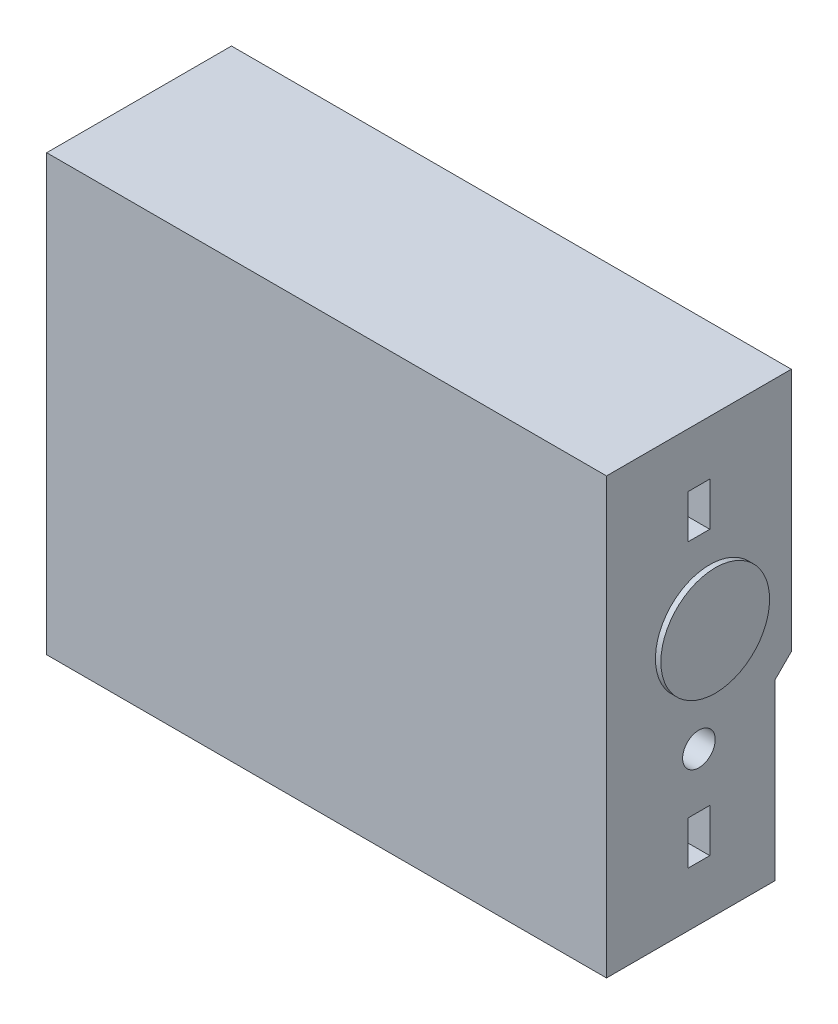
ISO-10303-21;
HEADER;
FILE_DESCRIPTION(('STEP AP214'),'2;1');
FILE_NAME('part.step','',(''),(''),'','','');
FILE_SCHEMA(('AUTOMOTIVE_DESIGN { 1 0 10303 214 1 1 1 1 }'));
ENDSEC;
DATA;
#1=APPLICATION_CONTEXT('core data for automotive mechanical design processes');
#2=APPLICATION_PROTOCOL_DEFINITION('international standard','automotive_design',2000,#1);
#3=PRODUCT_CONTEXT('',#1,'mechanical');
#4=PRODUCT('Part','Part','',(#3));
#5=PRODUCT_RELATED_PRODUCT_CATEGORY('part','',(#4));
#6=PRODUCT_DEFINITION_FORMATION('','',#4);
#7=PRODUCT_DEFINITION_CONTEXT('part definition',#1,'design');
#8=PRODUCT_DEFINITION('design','',#6,#7);
#9=PRODUCT_DEFINITION_SHAPE('','',#8);
#10=(LENGTH_UNIT() NAMED_UNIT(*) SI_UNIT(.MILLI.,.METRE.));
#11=(NAMED_UNIT(*) PLANE_ANGLE_UNIT() SI_UNIT($,.RADIAN.));
#12=(NAMED_UNIT(*) SI_UNIT($,.STERADIAN.) SOLID_ANGLE_UNIT());
#13=UNCERTAINTY_MEASURE_WITH_UNIT(LENGTH_MEASURE(1.E-05),#10,'distance_accuracy_value','');
#14=(GEOMETRIC_REPRESENTATION_CONTEXT(3) GLOBAL_UNCERTAINTY_ASSIGNED_CONTEXT((#13)) GLOBAL_UNIT_ASSIGNED_CONTEXT((#10,
#11,#12)) REPRESENTATION_CONTEXT('',''));
#15=CARTESIAN_POINT('',(0.,0.,0.));
#16=DIRECTION('',(0.,0.,1.));
#17=DIRECTION('',(1.,0.,0.));
#18=AXIS2_PLACEMENT_3D('',#15,#16,#17);
#19=CARTESIAN_POINT('',(51.5,40.,34.));
#20=DIRECTION('',(-1.,0.,0.));
#21=DIRECTION('',(0.,-1.,0.));
#22=AXIS2_PLACEMENT_3D('',#19,#20,#21);
#23=PLANE('',#22);
#24=CARTESIAN_POINT('',(51.5,6.36724846570491,15.));
#25=DIRECTION('',(-1.,0.,0.));
#26=DIRECTION('',(0.,-1.,0.));
#27=AXIS2_PLACEMENT_3D('',#24,#25,#26);
#28=CIRCLE('',#27,10.);
#29=CARTESIAN_POINT('',(51.5,-3.63275153429509,15.));
#30=VERTEX_POINT('',#29);
#31=EDGE_CURVE('E11',#30,#30,#28,.F.);
#32=ORIENTED_EDGE('',*,*,#31,.F.);
#33=EDGE_LOOP('',(#32));
#34=FACE_BOUND('',#33,.T.);
#35=DIRECTION('',(0.,0.,1.));
#36=VECTOR('',#35,1.);
#37=CARTESIAN_POINT('',(51.5,30.,19.));
#38=LINE('',#37,#36);
#39=CARTESIAN_POINT('',(51.5,30.,15.));
#40=VERTEX_POINT('',#39);
#41=CARTESIAN_POINT('',(51.5,30.,19.));
#42=VERTEX_POINT('',#41);
#43=EDGE_CURVE('E297',#40,#42,#38,.T.);
#44=ORIENTED_EDGE('',*,*,#43,.F.);
#45=DIRECTION('',(0.,1.,0.));
#46=VECTOR('',#45,1.);
#47=CARTESIAN_POINT('',(51.5,30.,15.));
#48=LINE('',#47,#46);
#49=CARTESIAN_POINT('',(51.5,22.,15.));
#50=VERTEX_POINT('',#49);
#51=EDGE_CURVE('E295',#50,#40,#48,.T.);
#52=ORIENTED_EDGE('',*,*,#51,.F.);
#53=DIRECTION('',(0.,0.,-1.));
#54=VECTOR('',#53,1.);
#55=CARTESIAN_POINT('',(51.5,22.,19.));
#56=LINE('',#55,#54);
#57=CARTESIAN_POINT('',(51.5,22.,19.));
#58=VERTEX_POINT('',#57);
#59=EDGE_CURVE('E285',#58,#50,#56,.T.);
#60=ORIENTED_EDGE('',*,*,#59,.F.);
#61=DIRECTION('',(0.,-1.,0.));
#62=VECTOR('',#61,1.);
#63=CARTESIAN_POINT('',(51.5,30.,19.));
#64=LINE('',#63,#62);
#65=EDGE_CURVE('E301',#42,#58,#64,.T.);
#66=ORIENTED_EDGE('',*,*,#65,.F.);
#67=EDGE_LOOP('',(#44,#52,#60,#66));
#68=FACE_BOUND('',#67,.T.);
#69=DIRECTION('',(0.,0.,1.));
#70=VECTOR('',#69,1.);
#71=CARTESIAN_POINT('',(51.5,-22.,19.));
#72=LINE('',#71,#70);
#73=CARTESIAN_POINT('',(51.5,-22.,15.));
#74=VERTEX_POINT('',#73);
#75=CARTESIAN_POINT('',(51.5,-22.,19.));
#76=VERTEX_POINT('',#75);
#77=EDGE_CURVE('E333',#74,#76,#72,.T.);
#78=ORIENTED_EDGE('',*,*,#77,.F.);
#79=DIRECTION('',(0.,1.,0.));
#80=VECTOR('',#79,1.);
#81=CARTESIAN_POINT('',(51.5,-30.,15.));
#82=LINE('',#81,#80);
#83=CARTESIAN_POINT('',(51.5,-30.,15.));
#84=VERTEX_POINT('',#83);
#85=EDGE_CURVE('E298',#84,#74,#82,.T.);
#86=ORIENTED_EDGE('',*,*,#85,.F.);
#87=DIRECTION('',(0.,0.,-1.));
#88=VECTOR('',#87,1.);
#89=CARTESIAN_POINT('',(51.5,-30.,19.));
#90=LINE('',#89,#88);
#91=CARTESIAN_POINT('',(51.5,-30.,19.));
#92=VERTEX_POINT('',#91);
#93=EDGE_CURVE('E326',#92,#84,#90,.T.);
#94=ORIENTED_EDGE('',*,*,#93,.F.);
#95=DIRECTION('',(0.,-1.,0.));
#96=VECTOR('',#95,1.);
#97=CARTESIAN_POINT('',(51.5,-30.,19.));
#98=LINE('',#97,#96);
#99=EDGE_CURVE('E329',#76,#92,#98,.T.);
#100=ORIENTED_EDGE('',*,*,#99,.F.);
#101=EDGE_LOOP('',(#78,#86,#94,#100));
#102=FACE_BOUND('',#101,.T.);
#103=CARTESIAN_POINT('',(51.5,-12.,17.));
#104=DIRECTION('',(1.,0.,0.));
#105=DIRECTION('',(0.,1.,0.));
#106=AXIS2_PLACEMENT_3D('',#103,#104,#105);
#107=CIRCLE('',#106,3.);
#108=CARTESIAN_POINT('',(51.5,-8.99999999999999,17.));
#109=VERTEX_POINT('',#108);
#110=EDGE_CURVE('E325',#109,#109,#107,.T.);
#111=ORIENTED_EDGE('',*,*,#110,.F.);
#112=EDGE_LOOP('',(#111));
#113=FACE_BOUND('',#112,.T.);
#114=DIRECTION('',(0.,-1.,0.));
#115=VECTOR('',#114,1.);
#116=CARTESIAN_POINT('',(51.5,40.,3.));
#117=LINE('',#116,#115);
#118=CARTESIAN_POINT('',(51.5,-7.99999999999998,3.));
#119=VERTEX_POINT('',#118);
#120=CARTESIAN_POINT('',(51.5,-40.,3.));
#121=VERTEX_POINT('',#120);
#122=EDGE_CURVE('E418',#119,#121,#117,.T.);
#123=ORIENTED_EDGE('',*,*,#122,.F.);
#124=DIRECTION('',(0.,0.707106781186548,-0.707106781186548));
#125=VECTOR('',#124,1.);
#126=CARTESIAN_POINT('',(51.5,0.500000000000014,-5.49999999999999));
#127=LINE('',#126,#125);
#128=CARTESIAN_POINT('',(51.5,-4.99999999999998,0.));
#129=VERTEX_POINT('',#128);
#130=EDGE_CURVE('E414',#119,#129,#127,.T.);
#131=ORIENTED_EDGE('',*,*,#130,.T.);
#132=DIRECTION('',(0.,1.,0.));
#133=VECTOR('',#132,1.);
#134=CARTESIAN_POINT('',(51.5,40.,0.));
#135=LINE('',#134,#133);
#136=CARTESIAN_POINT('',(51.5,40.,0.));
#137=VERTEX_POINT('',#136);
#138=EDGE_CURVE('E420',#129,#137,#135,.T.);
#139=ORIENTED_EDGE('',*,*,#138,.T.);
#140=DIRECTION('',(0.,0.,-1.));
#141=VECTOR('',#140,1.);
#142=CARTESIAN_POINT('',(51.5,40.,34.));
#143=LINE('',#142,#141);
#144=CARTESIAN_POINT('',(51.5,40.,34.));
#145=VERTEX_POINT('',#144);
#146=EDGE_CURVE('E445',#145,#137,#143,.T.);
#147=ORIENTED_EDGE('',*,*,#146,.F.);
#148=DIRECTION('',(0.,1.,0.));
#149=VECTOR('',#148,1.);
#150=CARTESIAN_POINT('',(51.5,40.,34.));
#151=LINE('',#150,#149);
#152=CARTESIAN_POINT('',(51.5,-40.,34.));
#153=VERTEX_POINT('',#152);
#154=EDGE_CURVE('E421',#153,#145,#151,.T.);
#155=ORIENTED_EDGE('',*,*,#154,.F.);
#156=DIRECTION('',(0.,0.,-1.));
#157=VECTOR('',#156,1.);
#158=CARTESIAN_POINT('',(51.5,-40.,34.));
#159=LINE('',#158,#157);
#160=EDGE_CURVE('E431',#153,#121,#159,.T.);
#161=ORIENTED_EDGE('',*,*,#160,.T.);
#162=EDGE_LOOP('',(#123,#131,#139,#147,#155,#161));
#163=FACE_BOUND('',#162,.T.);
#164=ADVANCED_FACE('F37',(#34,#68,#102,#113,#163),#23,.F.);
#165=CARTESIAN_POINT('',(-51.5,40.,34.));
#166=DIRECTION('',(1.,0.,0.));
#167=DIRECTION('',(0.,1.,0.));
#168=AXIS2_PLACEMENT_3D('',#165,#166,#167);
#169=PLANE('',#168);
#170=DIRECTION('',(0.,0.,-1.));
#171=VECTOR('',#170,1.);
#172=CARTESIAN_POINT('',(-51.5,-9.99279282193485,14.1061148654113));
#173=LINE('',#172,#171);
#174=CARTESIAN_POINT('',(-51.5,-9.99279282193485,22.1061148654113));
#175=VERTEX_POINT('',#174);
#176=CARTESIAN_POINT('',(-51.5,-9.99279282193485,14.1061148654113));
#177=VERTEX_POINT('',#176);
#178=EDGE_CURVE('E238',#175,#177,#173,.T.);
#179=ORIENTED_EDGE('',*,*,#178,.F.);
#180=DIRECTION('',(0.,1.,0.));
#181=VECTOR('',#180,1.);
#182=CARTESIAN_POINT('',(-51.5,-9.99279282193485,22.1061148654113));
#183=LINE('',#182,#181);
#184=CARTESIAN_POINT('',(-51.5,-27.9927928219349,22.1061148654113));
#185=VERTEX_POINT('',#184);
#186=EDGE_CURVE('E51',#185,#175,#183,.T.);
#187=ORIENTED_EDGE('',*,*,#186,.F.);
#188=DIRECTION('',(0.,0.,1.));
#189=VECTOR('',#188,1.);
#190=CARTESIAN_POINT('',(-51.5,-27.9927928219349,14.1061148654113));
#191=LINE('',#190,#189);
#192=CARTESIAN_POINT('',(-51.5,-27.9927928219349,14.1061148654113));
#193=VERTEX_POINT('',#192);
#194=EDGE_CURVE('E229',#193,#185,#191,.T.);
#195=ORIENTED_EDGE('',*,*,#194,.F.);
#196=DIRECTION('',(0.,-1.,0.));
#197=VECTOR('',#196,1.);
#198=CARTESIAN_POINT('',(-51.5,-9.99279282193485,14.1061148654113));
#199=LINE('',#198,#197);
#200=EDGE_CURVE('E232',#177,#193,#199,.T.);
#201=ORIENTED_EDGE('',*,*,#200,.F.);
#202=EDGE_LOOP('',(#179,#187,#195,#201));
#203=FACE_BOUND('',#202,.T.);
#204=DIRECTION('',(0.,0.,1.));
#205=VECTOR('',#204,1.);
#206=CARTESIAN_POINT('',(-51.5,16.6546169417566,17.2127259323421));
#207=LINE('',#206,#205);
#208=CARTESIAN_POINT('',(-51.5,16.6546169417566,17.2127259323421));
#209=VERTEX_POINT('',#208);
#210=CARTESIAN_POINT('',(-51.5,16.6546169417566,21.2127259323421));
#211=VERTEX_POINT('',#210);
#212=EDGE_CURVE('E264',#209,#211,#207,.T.);
#213=ORIENTED_EDGE('',*,*,#212,.F.);
#214=DIRECTION('',(0.,-1.,0.));
#215=VECTOR('',#214,1.);
#216=CARTESIAN_POINT('',(-51.5,28.6546169417566,17.2127259323421));
#217=LINE('',#216,#215);
#218=CARTESIAN_POINT('',(-51.5,28.6546169417566,17.2127259323421));
#219=VERTEX_POINT('',#218);
#220=EDGE_CURVE('E59',#219,#209,#217,.T.);
#221=ORIENTED_EDGE('',*,*,#220,.F.);
#222=DIRECTION('',(0.,0.,-1.));
#223=VECTOR('',#222,1.);
#224=CARTESIAN_POINT('',(-51.5,28.6546169417566,17.2127259323421));
#225=LINE('',#224,#223);
#226=CARTESIAN_POINT('',(-51.5,28.6546169417566,21.2127259323421));
#227=VERTEX_POINT('',#226);
#228=EDGE_CURVE('E257',#227,#219,#225,.T.);
#229=ORIENTED_EDGE('',*,*,#228,.F.);
#230=DIRECTION('',(0.,1.,0.));
#231=VECTOR('',#230,1.);
#232=CARTESIAN_POINT('',(-51.5,28.6546169417566,21.2127259323421));
#233=LINE('',#232,#231);
#234=EDGE_CURVE('E260',#211,#227,#233,.T.);
#235=ORIENTED_EDGE('',*,*,#234,.F.);
#236=EDGE_LOOP('',(#213,#221,#229,#235));
#237=FACE_BOUND('',#236,.T.);
#238=DIRECTION('',(0.,-1.,0.));
#239=VECTOR('',#238,1.);
#240=CARTESIAN_POINT('',(-51.5,0.,3.));
#241=LINE('',#240,#239);
#242=CARTESIAN_POINT('',(-51.5,-7.99999999999999,3.));
#243=VERTEX_POINT('',#242);
#244=CARTESIAN_POINT('',(-51.5,-40.,3.));
#245=VERTEX_POINT('',#244);
#246=EDGE_CURVE('E400',#243,#245,#241,.T.);
#247=ORIENTED_EDGE('',*,*,#246,.T.);
#248=DIRECTION('',(0.,0.,-1.));
#249=VECTOR('',#248,1.);
#250=CARTESIAN_POINT('',(-51.5,-40.,34.));
#251=LINE('',#250,#249);
#252=CARTESIAN_POINT('',(-51.5,-40.,34.));
#253=VERTEX_POINT('',#252);
#254=EDGE_CURVE('E439',#253,#245,#251,.T.);
#255=ORIENTED_EDGE('',*,*,#254,.F.);
#256=DIRECTION('',(0.,-1.,0.));
#257=VECTOR('',#256,1.);
#258=CARTESIAN_POINT('',(-51.5,40.,34.));
#259=LINE('',#258,#257);
#260=CARTESIAN_POINT('',(-51.5,40.,34.));
#261=VERTEX_POINT('',#260);
#262=EDGE_CURVE('E427',#261,#253,#259,.T.);
#263=ORIENTED_EDGE('',*,*,#262,.F.);
#264=DIRECTION('',(0.,0.,-1.));
#265=VECTOR('',#264,1.);
#266=CARTESIAN_POINT('',(-51.5,40.,34.));
#267=LINE('',#266,#265);
#268=CARTESIAN_POINT('',(-51.5,40.,0.));
#269=VERTEX_POINT('',#268);
#270=EDGE_CURVE('E442',#261,#269,#267,.T.);
#271=ORIENTED_EDGE('',*,*,#270,.T.);
#272=DIRECTION('',(0.,-1.,0.));
#273=VECTOR('',#272,1.);
#274=CARTESIAN_POINT('',(-51.5,40.,0.));
#275=LINE('',#274,#273);
#276=CARTESIAN_POINT('',(-51.5,-4.99999999999999,0.));
#277=VERTEX_POINT('',#276);
#278=EDGE_CURVE('E425',#269,#277,#275,.T.);
#279=ORIENTED_EDGE('',*,*,#278,.T.);
#280=DIRECTION('',(0.,0.707106781186548,-0.707106781186547));
#281=VECTOR('',#280,1.);
#282=CARTESIAN_POINT('',(-51.5,-2.5,-2.49999999999999));
#283=LINE('',#282,#281);
#284=EDGE_CURVE('E409',#243,#277,#283,.T.);
#285=ORIENTED_EDGE('',*,*,#284,.F.);
#286=EDGE_LOOP('',(#247,#255,#263,#271,#279,#285));
#287=FACE_BOUND('',#286,.T.);
#288=ADVANCED_FACE('F456',(#203,#237,#287),#169,.F.);
#289=CARTESIAN_POINT('',(-51.5,-40.,34.));
#290=DIRECTION('',(0.,1.,0.));
#291=DIRECTION('',(0.,0.,1.));
#292=AXIS2_PLACEMENT_3D('',#289,#290,#291);
#293=PLANE('',#292);
#294=DIRECTION('',(-1.,0.,0.));
#295=VECTOR('',#294,1.);
#296=CARTESIAN_POINT('',(172.5,-40.,3.));
#297=LINE('',#296,#295);
#298=EDGE_CURVE('E412',#121,#245,#297,.T.);
#299=ORIENTED_EDGE('',*,*,#298,.F.);
#300=ORIENTED_EDGE('',*,*,#160,.F.);
#301=DIRECTION('',(1.,0.,0.));
#302=VECTOR('',#301,1.);
#303=CARTESIAN_POINT('',(-51.5,-40.,34.));
#304=LINE('',#303,#302);
#305=EDGE_CURVE('E429',#253,#153,#304,.T.);
#306=ORIENTED_EDGE('',*,*,#305,.F.);
#307=ORIENTED_EDGE('',*,*,#254,.T.);
#308=EDGE_LOOP('',(#299,#300,#306,#307));
#309=FACE_BOUND('',#308,.T.);
#310=ADVANCED_FACE('F474',(#309),#293,.F.);
#311=CARTESIAN_POINT('',(-51.5,40.,34.));
#312=DIRECTION('',(0.,-1.,0.));
#313=DIRECTION('',(0.,0.,-1.));
#314=AXIS2_PLACEMENT_3D('',#311,#312,#313);
#315=PLANE('',#314);
#316=DIRECTION('',(-1.,0.,0.));
#317=VECTOR('',#316,1.);
#318=CARTESIAN_POINT('',(-51.5,40.,0.));
#319=LINE('',#318,#317);
#320=EDGE_CURVE('E433',#137,#269,#319,.T.);
#321=ORIENTED_EDGE('',*,*,#320,.T.);
#322=ORIENTED_EDGE('',*,*,#270,.F.);
#323=DIRECTION('',(-1.,0.,0.));
#324=VECTOR('',#323,1.);
#325=CARTESIAN_POINT('',(-51.5,40.,34.));
#326=LINE('',#325,#324);
#327=EDGE_CURVE('E424',#145,#261,#326,.T.);
#328=ORIENTED_EDGE('',*,*,#327,.F.);
#329=ORIENTED_EDGE('',*,*,#146,.T.);
#330=EDGE_LOOP('',(#321,#322,#328,#329));
#331=FACE_BOUND('',#330,.T.);
#332=ADVANCED_FACE('F461',(#331),#315,.F.);
#333=CARTESIAN_POINT('',(0.,0.,34.));
#334=DIRECTION('',(0.,0.,1.));
#335=DIRECTION('',(1.,0.,0.));
#336=AXIS2_PLACEMENT_3D('',#333,#334,#335);
#337=PLANE('',#336);
#338=ORIENTED_EDGE('',*,*,#154,.T.);
#339=ORIENTED_EDGE('',*,*,#327,.T.);
#340=ORIENTED_EDGE('',*,*,#262,.T.);
#341=ORIENTED_EDGE('',*,*,#305,.T.);
#342=EDGE_LOOP('',(#338,#339,#340,#341));
#343=FACE_BOUND('',#342,.T.);
#344=ADVANCED_FACE('F477',(#343),#337,.T.);
#345=CARTESIAN_POINT('',(0.,0.,0.));
#346=DIRECTION('',(0.,0.,1.));
#347=DIRECTION('',(1.,0.,0.));
#348=AXIS2_PLACEMENT_3D('',#345,#346,#347);
#349=PLANE('',#348);
#350=DIRECTION('',(1.,0.,0.));
#351=VECTOR('',#350,1.);
#352=CARTESIAN_POINT('',(31.7301215207609,27.5,0.));
#353=LINE('',#352,#351);
#354=CARTESIAN_POINT('',(-31.7301215207608,27.5,0.));
#355=VERTEX_POINT('',#354);
#356=CARTESIAN_POINT('',(31.7301215207609,27.5,0.));
#357=VERTEX_POINT('',#356);
#358=EDGE_CURVE('E390',#355,#357,#353,.T.);
#359=ORIENTED_EDGE('',*,*,#358,.F.);
#360=DIRECTION('',(0.,1.,0.));
#361=VECTOR('',#360,1.);
#362=CARTESIAN_POINT('',(-31.7301215207608,27.5,0.));
#363=LINE('',#362,#361);
#364=CARTESIAN_POINT('',(-31.7301215207608,7.50000000000004,0.));
#365=VERTEX_POINT('',#364);
#366=EDGE_CURVE('E372',#365,#355,#363,.T.);
#367=ORIENTED_EDGE('',*,*,#366,.F.);
#368=DIRECTION('',(-1.,0.,0.));
#369=VECTOR('',#368,1.);
#370=CARTESIAN_POINT('',(31.7301215207609,7.50000000000001,0.));
#371=LINE('',#370,#369);
#372=CARTESIAN_POINT('',(31.7301215207609,7.50000000000001,0.));
#373=VERTEX_POINT('',#372);
#374=EDGE_CURVE('E379',#373,#365,#371,.T.);
#375=ORIENTED_EDGE('',*,*,#374,.F.);
#376=DIRECTION('',(0.,-1.,0.));
#377=VECTOR('',#376,1.);
#378=CARTESIAN_POINT('',(31.7301215207609,27.5,0.));
#379=LINE('',#378,#377);
#380=EDGE_CURVE('E393',#357,#373,#379,.T.);
#381=ORIENTED_EDGE('',*,*,#380,.F.);
#382=EDGE_LOOP('',(#359,#367,#375,#381));
#383=FACE_BOUND('',#382,.T.);
#384=ORIENTED_EDGE('',*,*,#138,.F.);
#385=DIRECTION('',(-1.,0.,0.));
#386=VECTOR('',#385,1.);
#387=CARTESIAN_POINT('',(0.,-4.99999999999998,0.));
#388=LINE('',#387,#386);
#389=EDGE_CURVE('E44',#129,#277,#388,.T.);
#390=ORIENTED_EDGE('',*,*,#389,.T.);
#391=ORIENTED_EDGE('',*,*,#278,.F.);
#392=ORIENTED_EDGE('',*,*,#320,.F.);
#393=EDGE_LOOP('',(#384,#390,#391,#392));
#394=FACE_BOUND('',#393,.T.);
#395=ADVANCED_FACE('F451',(#383,#394),#349,.F.);
#396=CARTESIAN_POINT('',(172.5,0.,3.));
#397=DIRECTION('',(0.,0.,-1.));
#398=DIRECTION('',(0.,1.,0.));
#399=AXIS2_PLACEMENT_3D('',#396,#397,#398);
#400=PLANE('',#399);
#401=CARTESIAN_POINT('',(-22.5,-20.,3.));
#402=DIRECTION('',(0.,0.,-1.));
#403=DIRECTION('',(0.,1.,0.));
#404=AXIS2_PLACEMENT_3D('',#401,#402,#403);
#405=CIRCLE('',#404,4.00000000000001);
#406=CARTESIAN_POINT('',(-22.5,-16.,3.));
#407=VERTEX_POINT('',#406);
#408=EDGE_CURVE('E351',#407,#407,#405,.T.);
#409=ORIENTED_EDGE('',*,*,#408,.F.);
#410=EDGE_LOOP('',(#409));
#411=FACE_BOUND('',#410,.T.);
#412=CARTESIAN_POINT('',(-7.5,-20.,3.));
#413=DIRECTION('',(0.,0.,-1.));
#414=DIRECTION('',(0.,1.,0.));
#415=AXIS2_PLACEMENT_3D('',#412,#413,#414);
#416=CIRCLE('',#415,4.);
#417=CARTESIAN_POINT('',(-7.5,-16.,3.));
#418=VERTEX_POINT('',#417);
#419=EDGE_CURVE('E357',#418,#418,#416,.T.);
#420=ORIENTED_EDGE('',*,*,#419,.F.);
#421=EDGE_LOOP('',(#420));
#422=FACE_BOUND('',#421,.T.);
#423=CARTESIAN_POINT('',(22.5,-20.,3.));
#424=DIRECTION('',(0.,0.,-1.));
#425=DIRECTION('',(0.,1.,0.));
#426=AXIS2_PLACEMENT_3D('',#423,#424,#425);
#427=CIRCLE('',#426,4.);
#428=CARTESIAN_POINT('',(22.5,-16.,3.));
#429=VERTEX_POINT('',#428);
#430=EDGE_CURVE('E363',#429,#429,#427,.T.);
#431=ORIENTED_EDGE('',*,*,#430,.F.);
#432=EDGE_LOOP('',(#431));
#433=FACE_BOUND('',#432,.T.);
#434=CARTESIAN_POINT('',(7.5,-20.,3.));
#435=DIRECTION('',(0.,0.,-1.));
#436=DIRECTION('',(0.,1.,0.));
#437=AXIS2_PLACEMENT_3D('',#434,#435,#436);
#438=CIRCLE('',#437,4.);
#439=CARTESIAN_POINT('',(7.5,-16.,3.));
#440=VERTEX_POINT('',#439);
#441=EDGE_CURVE('E366',#440,#440,#438,.T.);
#442=ORIENTED_EDGE('',*,*,#441,.F.);
#443=EDGE_LOOP('',(#442));
#444=FACE_BOUND('',#443,.T.);
#445=ORIENTED_EDGE('',*,*,#122,.T.);
#446=ORIENTED_EDGE('',*,*,#298,.T.);
#447=ORIENTED_EDGE('',*,*,#246,.F.);
#448=DIRECTION('',(-1.,0.,0.));
#449=VECTOR('',#448,1.);
#450=CARTESIAN_POINT('',(172.5,-7.99999999999996,3.));
#451=LINE('',#450,#449);
#452=EDGE_CURVE('E411',#119,#243,#451,.T.);
#453=ORIENTED_EDGE('',*,*,#452,.F.);
#454=EDGE_LOOP('',(#445,#446,#447,#453));
#455=FACE_BOUND('',#454,.T.);
#456=ADVANCED_FACE('F470',(#411,#422,#433,#444,#455),#400,.T.);
#457=CARTESIAN_POINT('',(172.5,-2.49999999999996,-2.49999999999999));
#458=DIRECTION('',(0.,0.707106781186547,0.707106781186547));
#459=DIRECTION('',(0.,-0.707106781186548,0.707106781186548));
#460=AXIS2_PLACEMENT_3D('',#457,#458,#459);
#461=PLANE('',#460);
#462=ORIENTED_EDGE('',*,*,#452,.T.);
#463=ORIENTED_EDGE('',*,*,#284,.T.);
#464=ORIENTED_EDGE('',*,*,#389,.F.);
#465=ORIENTED_EDGE('',*,*,#130,.F.);
#466=EDGE_LOOP('',(#462,#463,#464,#465));
#467=FACE_BOUND('',#466,.T.);
#468=ADVANCED_FACE('F467',(#467),#461,.F.);
#469=CARTESIAN_POINT('',(-31.7301215207608,27.5,1.));
#470=DIRECTION('',(-1.,0.,0.));
#471=DIRECTION('',(0.,-1.,0.));
#472=AXIS2_PLACEMENT_3D('',#469,#470,#471);
#473=PLANE('',#472);
#474=ORIENTED_EDGE('',*,*,#366,.T.);
#475=DIRECTION('',(0.,0.,-1.));
#476=VECTOR('',#475,1.);
#477=CARTESIAN_POINT('',(-31.7301215207608,27.5,1.));
#478=LINE('',#477,#476);
#479=CARTESIAN_POINT('',(-31.7301215207608,27.5,1.));
#480=VERTEX_POINT('',#479);
#481=EDGE_CURVE('E388',#480,#355,#478,.T.);
#482=ORIENTED_EDGE('',*,*,#481,.F.);
#483=DIRECTION('',(0.,1.,0.));
#484=VECTOR('',#483,1.);
#485=CARTESIAN_POINT('',(-31.7301215207608,27.5,1.));
#486=LINE('',#485,#484);
#487=CARTESIAN_POINT('',(-31.7301215207608,7.50000000000004,1.));
#488=VERTEX_POINT('',#487);
#489=EDGE_CURVE('E375',#488,#480,#486,.T.);
#490=ORIENTED_EDGE('',*,*,#489,.F.);
#491=DIRECTION('',(0.,0.,-1.));
#492=VECTOR('',#491,1.);
#493=CARTESIAN_POINT('',(-31.7301215207608,7.50000000000004,1.));
#494=LINE('',#493,#492);
#495=EDGE_CURVE('E398',#488,#365,#494,.T.);
#496=ORIENTED_EDGE('',*,*,#495,.T.);
#497=EDGE_LOOP('',(#474,#482,#490,#496));
#498=FACE_BOUND('',#497,.T.);
#499=ADVANCED_FACE('F563',(#498),#473,.F.);
#500=CARTESIAN_POINT('',(31.7301215207609,7.50000000000001,1.));
#501=DIRECTION('',(0.,-1.,0.));
#502=DIRECTION('',(1.,0.,0.));
#503=AXIS2_PLACEMENT_3D('',#500,#501,#502);
#504=PLANE('',#503);
#505=ORIENTED_EDGE('',*,*,#374,.T.);
#506=ORIENTED_EDGE('',*,*,#495,.F.);
#507=DIRECTION('',(-1.,0.,0.));
#508=VECTOR('',#507,1.);
#509=CARTESIAN_POINT('',(31.7301215207609,7.50000000000001,1.));
#510=LINE('',#509,#508);
#511=CARTESIAN_POINT('',(31.7301215207609,7.50000000000001,1.));
#512=VERTEX_POINT('',#511);
#513=EDGE_CURVE('E385',#512,#488,#510,.T.);
#514=ORIENTED_EDGE('',*,*,#513,.F.);
#515=DIRECTION('',(0.,0.,-1.));
#516=VECTOR('',#515,1.);
#517=CARTESIAN_POINT('',(31.7301215207609,7.50000000000001,1.));
#518=LINE('',#517,#516);
#519=EDGE_CURVE('E401',#512,#373,#518,.T.);
#520=ORIENTED_EDGE('',*,*,#519,.T.);
#521=EDGE_LOOP('',(#505,#506,#514,#520));
#522=FACE_BOUND('',#521,.T.);
#523=ADVANCED_FACE('F559',(#522),#504,.F.);
#524=CARTESIAN_POINT('',(31.7301215207609,27.5,1.));
#525=DIRECTION('',(1.,0.,0.));
#526=DIRECTION('',(0.,1.,0.));
#527=AXIS2_PLACEMENT_3D('',#524,#525,#526);
#528=PLANE('',#527);
#529=ORIENTED_EDGE('',*,*,#380,.T.);
#530=ORIENTED_EDGE('',*,*,#519,.F.);
#531=DIRECTION('',(0.,-1.,0.));
#532=VECTOR('',#531,1.);
#533=CARTESIAN_POINT('',(31.7301215207609,27.5,1.));
#534=LINE('',#533,#532);
#535=CARTESIAN_POINT('',(31.7301215207609,27.5,1.));
#536=VERTEX_POINT('',#535);
#537=EDGE_CURVE('E382',#536,#512,#534,.T.);
#538=ORIENTED_EDGE('',*,*,#537,.F.);
#539=DIRECTION('',(0.,0.,-1.));
#540=VECTOR('',#539,1.);
#541=CARTESIAN_POINT('',(31.7301215207609,27.5,1.));
#542=LINE('',#541,#540);
#543=EDGE_CURVE('E403',#536,#357,#542,.T.);
#544=ORIENTED_EDGE('',*,*,#543,.T.);
#545=EDGE_LOOP('',(#529,#530,#538,#544));
#546=FACE_BOUND('',#545,.T.);
#547=ADVANCED_FACE('F562',(#546),#528,.F.);
#548=CARTESIAN_POINT('',(31.7301215207609,27.5,1.));
#549=DIRECTION('',(0.,1.,0.));
#550=DIRECTION('',(0.,0.,1.));
#551=AXIS2_PLACEMENT_3D('',#548,#549,#550);
#552=PLANE('',#551);
#553=ORIENTED_EDGE('',*,*,#358,.T.);
#554=ORIENTED_EDGE('',*,*,#543,.F.);
#555=DIRECTION('',(1.,0.,0.));
#556=VECTOR('',#555,1.);
#557=CARTESIAN_POINT('',(31.7301215207609,27.5,1.));
#558=LINE('',#557,#556);
#559=EDGE_CURVE('E378',#480,#536,#558,.T.);
#560=ORIENTED_EDGE('',*,*,#559,.F.);
#561=ORIENTED_EDGE('',*,*,#481,.T.);
#562=EDGE_LOOP('',(#553,#554,#560,#561));
#563=FACE_BOUND('',#562,.T.);
#564=ADVANCED_FACE('F557',(#563),#552,.F.);
#565=CARTESIAN_POINT('',(0.,0.,1.));
#566=DIRECTION('',(0.,0.,-1.));
#567=DIRECTION('',(-1.,0.,0.));
#568=AXIS2_PLACEMENT_3D('',#565,#566,#567);
#569=PLANE('',#568);
#570=ORIENTED_EDGE('',*,*,#489,.T.);
#571=ORIENTED_EDGE('',*,*,#559,.T.);
#572=ORIENTED_EDGE('',*,*,#537,.T.);
#573=ORIENTED_EDGE('',*,*,#513,.T.);
#574=EDGE_LOOP('',(#570,#571,#572,#573));
#575=FACE_BOUND('',#574,.T.);
#576=ADVANCED_FACE('F553',(#575),#569,.T.);
#577=CARTESIAN_POINT('',(7.5,-20.,2.));
#578=DIRECTION('',(0.,0.,1.));
#579=DIRECTION('',(0.,-1.,0.));
#580=AXIS2_PLACEMENT_3D('',#577,#578,#579);
#581=CYLINDRICAL_SURFACE('',#580,4.);
#582=CARTESIAN_POINT('',(7.5,-20.,2.));
#583=DIRECTION('',(0.,0.,-1.));
#584=DIRECTION('',(0.,1.,0.));
#585=AXIS2_PLACEMENT_3D('',#582,#583,#584);
#586=CIRCLE('',#585,4.);
#587=CARTESIAN_POINT('',(7.5,-16.,2.));
#588=VERTEX_POINT('',#587);
#589=EDGE_CURVE('E369',#588,#588,#586,.T.);
#590=ORIENTED_EDGE('',*,*,#589,.F.);
#591=EDGE_LOOP('',(#590));
#592=FACE_BOUND('',#591,.T.);
#593=ORIENTED_EDGE('',*,*,#441,.T.);
#594=EDGE_LOOP('',(#593));
#595=FACE_BOUND('',#594,.T.);
#596=ADVANCED_FACE('F549',(#592,#595),#581,.T.);
#597=CARTESIAN_POINT('',(7.5,-20.,2.));
#598=DIRECTION('',(0.,0.,-1.));
#599=DIRECTION('',(0.,1.,0.));
#600=AXIS2_PLACEMENT_3D('',#597,#598,#599);
#601=PLANE('',#600);
#602=ORIENTED_EDGE('',*,*,#589,.T.);
#603=EDGE_LOOP('',(#602));
#604=FACE_BOUND('',#603,.T.);
#605=ADVANCED_FACE('F542',(#604),#601,.T.);
#606=CARTESIAN_POINT('',(22.5,-20.,2.));
#607=DIRECTION('',(0.,0.,1.));
#608=DIRECTION('',(0.,-1.,0.));
#609=AXIS2_PLACEMENT_3D('',#606,#607,#608);
#610=CYLINDRICAL_SURFACE('',#609,4.);
#611=CARTESIAN_POINT('',(22.5,-20.,2.));
#612=DIRECTION('',(0.,0.,-1.));
#613=DIRECTION('',(0.,1.,0.));
#614=AXIS2_PLACEMENT_3D('',#611,#612,#613);
#615=CIRCLE('',#614,4.);
#616=CARTESIAN_POINT('',(22.5,-16.,2.));
#617=VERTEX_POINT('',#616);
#618=EDGE_CURVE('E360',#617,#617,#615,.T.);
#619=ORIENTED_EDGE('',*,*,#618,.F.);
#620=EDGE_LOOP('',(#619));
#621=FACE_BOUND('',#620,.T.);
#622=ORIENTED_EDGE('',*,*,#430,.T.);
#623=EDGE_LOOP('',(#622));
#624=FACE_BOUND('',#623,.T.);
#625=ADVANCED_FACE('F539',(#621,#624),#610,.T.);
#626=CARTESIAN_POINT('',(22.5,-20.,2.));
#627=DIRECTION('',(0.,0.,-1.));
#628=DIRECTION('',(0.,1.,0.));
#629=AXIS2_PLACEMENT_3D('',#626,#627,#628);
#630=PLANE('',#629);
#631=ORIENTED_EDGE('',*,*,#618,.T.);
#632=EDGE_LOOP('',(#631));
#633=FACE_BOUND('',#632,.T.);
#634=ADVANCED_FACE('F534',(#633),#630,.T.);
#635=CARTESIAN_POINT('',(-7.5,-20.,2.));
#636=DIRECTION('',(0.,0.,1.));
#637=DIRECTION('',(0.,-1.,0.));
#638=AXIS2_PLACEMENT_3D('',#635,#636,#637);
#639=CYLINDRICAL_SURFACE('',#638,4.);
#640=CARTESIAN_POINT('',(-7.5,-20.,2.));
#641=DIRECTION('',(0.,0.,-1.));
#642=DIRECTION('',(0.,1.,0.));
#643=AXIS2_PLACEMENT_3D('',#640,#641,#642);
#644=CIRCLE('',#643,4.);
#645=CARTESIAN_POINT('',(-7.5,-16.,2.));
#646=VERTEX_POINT('',#645);
#647=EDGE_CURVE('E354',#646,#646,#644,.T.);
#648=ORIENTED_EDGE('',*,*,#647,.F.);
#649=EDGE_LOOP('',(#648));
#650=FACE_BOUND('',#649,.T.);
#651=ORIENTED_EDGE('',*,*,#419,.T.);
#652=EDGE_LOOP('',(#651));
#653=FACE_BOUND('',#652,.T.);
#654=ADVANCED_FACE('F531',(#650,#653),#639,.T.);
#655=CARTESIAN_POINT('',(-7.5,-20.,2.));
#656=DIRECTION('',(0.,0.,-1.));
#657=DIRECTION('',(0.,1.,0.));
#658=AXIS2_PLACEMENT_3D('',#655,#656,#657);
#659=PLANE('',#658);
#660=ORIENTED_EDGE('',*,*,#647,.T.);
#661=EDGE_LOOP('',(#660));
#662=FACE_BOUND('',#661,.T.);
#663=ADVANCED_FACE('F528',(#662),#659,.T.);
#664=CARTESIAN_POINT('',(-22.5,-20.,2.));
#665=DIRECTION('',(0.,0.,1.));
#666=DIRECTION('',(0.,-1.,0.));
#667=AXIS2_PLACEMENT_3D('',#664,#665,#666);
#668=CYLINDRICAL_SURFACE('',#667,4.00000000000001);
#669=CARTESIAN_POINT('',(-22.5,-20.,2.));
#670=DIRECTION('',(0.,0.,-1.));
#671=DIRECTION('',(0.,1.,0.));
#672=AXIS2_PLACEMENT_3D('',#669,#670,#671);
#673=CIRCLE('',#672,4.00000000000001);
#674=CARTESIAN_POINT('',(-22.5,-16.,2.));
#675=VERTEX_POINT('',#674);
#676=EDGE_CURVE('E308',#675,#675,#673,.T.);
#677=ORIENTED_EDGE('',*,*,#676,.F.);
#678=EDGE_LOOP('',(#677));
#679=FACE_BOUND('',#678,.T.);
#680=ORIENTED_EDGE('',*,*,#408,.T.);
#681=EDGE_LOOP('',(#680));
#682=FACE_BOUND('',#681,.T.);
#683=ADVANCED_FACE('F519',(#679,#682),#668,.T.);
#684=CARTESIAN_POINT('',(-22.5,-20.,2.));
#685=DIRECTION('',(0.,0.,-1.));
#686=DIRECTION('',(0.,1.,0.));
#687=AXIS2_PLACEMENT_3D('',#684,#685,#686);
#688=PLANE('',#687);
#689=ORIENTED_EDGE('',*,*,#676,.T.);
#690=EDGE_LOOP('',(#689));
#691=FACE_BOUND('',#690,.T.);
#692=ADVANCED_FACE('F509',(#691),#688,.T.);
#693=CARTESIAN_POINT('',(46.5,-12.,17.));
#694=DIRECTION('',(1.,0.,0.));
#695=DIRECTION('',(0.,1.,0.));
#696=AXIS2_PLACEMENT_3D('',#693,#694,#695);
#697=CYLINDRICAL_SURFACE('',#696,3.);
#698=CARTESIAN_POINT('',(46.5,-12.,17.));
#699=DIRECTION('',(1.,0.,0.));
#700=DIRECTION('',(0.,1.,0.));
#701=AXIS2_PLACEMENT_3D('',#698,#699,#700);
#702=CIRCLE('',#701,3.);
#703=CARTESIAN_POINT('',(46.5,-8.99999999999999,17.));
#704=VERTEX_POINT('',#703);
#705=EDGE_CURVE('E280',#704,#704,#702,.T.);
#706=ORIENTED_EDGE('',*,*,#705,.F.);
#707=EDGE_LOOP('',(#706));
#708=FACE_BOUND('',#707,.T.);
#709=ORIENTED_EDGE('',*,*,#110,.T.);
#710=EDGE_LOOP('',(#709));
#711=FACE_BOUND('',#710,.T.);
#712=ADVANCED_FACE('F506',(#708,#711),#697,.F.);
#713=CARTESIAN_POINT('',(46.5,-12.,17.));
#714=DIRECTION('',(1.,0.,0.));
#715=DIRECTION('',(0.,1.,0.));
#716=AXIS2_PLACEMENT_3D('',#713,#714,#715);
#717=PLANE('',#716);
#718=ORIENTED_EDGE('',*,*,#705,.T.);
#719=EDGE_LOOP('',(#718));
#720=FACE_BOUND('',#719,.T.);
#721=ADVANCED_FACE('F508',(#720),#717,.T.);
#722=CARTESIAN_POINT('',(46.5,-30.,15.));
#723=DIRECTION('',(0.,0.,-1.));
#724=DIRECTION('',(-1.,0.,0.));
#725=AXIS2_PLACEMENT_3D('',#722,#723,#724);
#726=PLANE('',#725);
#727=ORIENTED_EDGE('',*,*,#85,.T.);
#728=DIRECTION('',(1.,0.,0.));
#729=VECTOR('',#728,1.);
#730=CARTESIAN_POINT('',(46.5,-22.,15.));
#731=LINE('',#730,#729);
#732=CARTESIAN_POINT('',(46.5,-22.,15.));
#733=VERTEX_POINT('',#732);
#734=EDGE_CURVE('E315',#733,#74,#731,.T.);
#735=ORIENTED_EDGE('',*,*,#734,.F.);
#736=DIRECTION('',(0.,1.,0.));
#737=VECTOR('',#736,1.);
#738=CARTESIAN_POINT('',(46.5,-30.,15.));
#739=LINE('',#738,#737);
#740=CARTESIAN_POINT('',(46.5,-30.,15.));
#741=VERTEX_POINT('',#740);
#742=EDGE_CURVE('E330',#741,#733,#739,.T.);
#743=ORIENTED_EDGE('',*,*,#742,.F.);
#744=DIRECTION('',(1.,0.,0.));
#745=VECTOR('',#744,1.);
#746=CARTESIAN_POINT('',(46.5,-30.,15.));
#747=LINE('',#746,#745);
#748=EDGE_CURVE('E323',#741,#84,#747,.T.);
#749=ORIENTED_EDGE('',*,*,#748,.T.);
#750=EDGE_LOOP('',(#727,#735,#743,#749));
#751=FACE_BOUND('',#750,.T.);
#752=ADVANCED_FACE('F516',(#751),#726,.F.);
#753=CARTESIAN_POINT('',(46.5,-30.,19.));
#754=DIRECTION('',(0.,-1.,0.));
#755=DIRECTION('',(1.,0.,0.));
#756=AXIS2_PLACEMENT_3D('',#753,#754,#755);
#757=PLANE('',#756);
#758=ORIENTED_EDGE('',*,*,#93,.T.);
#759=ORIENTED_EDGE('',*,*,#748,.F.);
#760=DIRECTION('',(0.,0.,-1.));
#761=VECTOR('',#760,1.);
#762=CARTESIAN_POINT('',(46.5,-30.,19.));
#763=LINE('',#762,#761);
#764=CARTESIAN_POINT('',(46.5,-30.,19.));
#765=VERTEX_POINT('',#764);
#766=EDGE_CURVE('E318',#765,#741,#763,.T.);
#767=ORIENTED_EDGE('',*,*,#766,.F.);
#768=DIRECTION('',(1.,0.,0.));
#769=VECTOR('',#768,1.);
#770=CARTESIAN_POINT('',(46.5,-30.,19.));
#771=LINE('',#770,#769);
#772=EDGE_CURVE('E321',#765,#92,#771,.T.);
#773=ORIENTED_EDGE('',*,*,#772,.T.);
#774=EDGE_LOOP('',(#758,#759,#767,#773));
#775=FACE_BOUND('',#774,.T.);
#776=ADVANCED_FACE('F671',(#775),#757,.F.);
#777=CARTESIAN_POINT('',(46.5,-30.,19.));
#778=DIRECTION('',(0.,0.,1.));
#779=DIRECTION('',(1.,0.,0.));
#780=AXIS2_PLACEMENT_3D('',#777,#778,#779);
#781=PLANE('',#780);
#782=ORIENTED_EDGE('',*,*,#99,.T.);
#783=ORIENTED_EDGE('',*,*,#772,.F.);
#784=DIRECTION('',(0.,-1.,0.));
#785=VECTOR('',#784,1.);
#786=CARTESIAN_POINT('',(46.5,-30.,19.));
#787=LINE('',#786,#785);
#788=CARTESIAN_POINT('',(46.5,-22.,19.));
#789=VERTEX_POINT('',#788);
#790=EDGE_CURVE('E339',#789,#765,#787,.T.);
#791=ORIENTED_EDGE('',*,*,#790,.F.);
#792=DIRECTION('',(1.,0.,0.));
#793=VECTOR('',#792,1.);
#794=CARTESIAN_POINT('',(46.5,-22.,19.));
#795=LINE('',#794,#793);
#796=EDGE_CURVE('E319',#789,#76,#795,.T.);
#797=ORIENTED_EDGE('',*,*,#796,.T.);
#798=EDGE_LOOP('',(#782,#783,#791,#797));
#799=FACE_BOUND('',#798,.T.);
#800=ADVANCED_FACE('F682',(#799),#781,.F.);
#801=CARTESIAN_POINT('',(46.5,-22.,19.));
#802=DIRECTION('',(0.,1.,0.));
#803=DIRECTION('',(-1.,0.,0.));
#804=AXIS2_PLACEMENT_3D('',#801,#802,#803);
#805=PLANE('',#804);
#806=ORIENTED_EDGE('',*,*,#77,.T.);
#807=ORIENTED_EDGE('',*,*,#796,.F.);
#808=DIRECTION('',(0.,0.,1.));
#809=VECTOR('',#808,1.);
#810=CARTESIAN_POINT('',(46.5,-22.,19.));
#811=LINE('',#810,#809);
#812=EDGE_CURVE('E342',#733,#789,#811,.T.);
#813=ORIENTED_EDGE('',*,*,#812,.F.);
#814=ORIENTED_EDGE('',*,*,#734,.T.);
#815=EDGE_LOOP('',(#806,#807,#813,#814));
#816=FACE_BOUND('',#815,.T.);
#817=ADVANCED_FACE('F692',(#816),#805,.F.);
#818=CARTESIAN_POINT('',(46.5,0.,0.));
#819=DIRECTION('',(-1.,0.,0.));
#820=DIRECTION('',(0.,0.,1.));
#821=AXIS2_PLACEMENT_3D('',#818,#819,#820);
#822=PLANE('',#821);
#823=ORIENTED_EDGE('',*,*,#742,.T.);
#824=ORIENTED_EDGE('',*,*,#812,.T.);
#825=ORIENTED_EDGE('',*,*,#790,.T.);
#826=ORIENTED_EDGE('',*,*,#766,.T.);
#827=EDGE_LOOP('',(#823,#824,#825,#826));
#828=FACE_BOUND('',#827,.T.);
#829=ADVANCED_FACE('F524',(#828),#822,.F.);
#830=CARTESIAN_POINT('',(46.5,30.,15.));
#831=DIRECTION('',(0.,0.,-1.));
#832=DIRECTION('',(0.,1.,0.));
#833=AXIS2_PLACEMENT_3D('',#830,#831,#832);
#834=PLANE('',#833);
#835=ORIENTED_EDGE('',*,*,#51,.T.);
#836=DIRECTION('',(1.,0.,0.));
#837=VECTOR('',#836,1.);
#838=CARTESIAN_POINT('',(46.5,30.,15.));
#839=LINE('',#838,#837);
#840=CARTESIAN_POINT('',(46.5,30.,15.));
#841=VERTEX_POINT('',#840);
#842=EDGE_CURVE('E294',#841,#40,#839,.T.);
#843=ORIENTED_EDGE('',*,*,#842,.F.);
#844=DIRECTION('',(0.,1.,0.));
#845=VECTOR('',#844,1.);
#846=CARTESIAN_POINT('',(46.5,30.,15.));
#847=LINE('',#846,#845);
#848=CARTESIAN_POINT('',(46.5,22.,15.));
#849=VERTEX_POINT('',#848);
#850=EDGE_CURVE('E281',#849,#841,#847,.T.);
#851=ORIENTED_EDGE('',*,*,#850,.F.);
#852=DIRECTION('',(1.,0.,0.));
#853=VECTOR('',#852,1.);
#854=CARTESIAN_POINT('',(46.5,22.,15.));
#855=LINE('',#854,#853);
#856=EDGE_CURVE('E306',#849,#50,#855,.T.);
#857=ORIENTED_EDGE('',*,*,#856,.T.);
#858=EDGE_LOOP('',(#835,#843,#851,#857));
#859=FACE_BOUND('',#858,.T.);
#860=ADVANCED_FACE('F713',(#859),#834,.F.);
#861=CARTESIAN_POINT('',(46.5,22.,19.));
#862=DIRECTION('',(0.,-1.,0.));
#863=DIRECTION('',(1.,0.,0.));
#864=AXIS2_PLACEMENT_3D('',#861,#862,#863);
#865=PLANE('',#864);
#866=ORIENTED_EDGE('',*,*,#59,.T.);
#867=ORIENTED_EDGE('',*,*,#856,.F.);
#868=DIRECTION('',(0.,0.,-1.));
#869=VECTOR('',#868,1.);
#870=CARTESIAN_POINT('',(46.5,22.,19.));
#871=LINE('',#870,#869);
#872=CARTESIAN_POINT('',(46.5,22.,19.));
#873=VERTEX_POINT('',#872);
#874=EDGE_CURVE('E291',#873,#849,#871,.T.);
#875=ORIENTED_EDGE('',*,*,#874,.F.);
#876=DIRECTION('',(1.,0.,0.));
#877=VECTOR('',#876,1.);
#878=CARTESIAN_POINT('',(46.5,22.,19.));
#879=LINE('',#878,#877);
#880=EDGE_CURVE('E309',#873,#58,#879,.T.);
#881=ORIENTED_EDGE('',*,*,#880,.T.);
#882=EDGE_LOOP('',(#866,#867,#875,#881));
#883=FACE_BOUND('',#882,.T.);
#884=ADVANCED_FACE('F723',(#883),#865,.F.);
#885=CARTESIAN_POINT('',(46.5,30.,19.));
#886=DIRECTION('',(0.,0.,1.));
#887=DIRECTION('',(1.,0.,0.));
#888=AXIS2_PLACEMENT_3D('',#885,#886,#887);
#889=PLANE('',#888);
#890=ORIENTED_EDGE('',*,*,#65,.T.);
#891=ORIENTED_EDGE('',*,*,#880,.F.);
#892=DIRECTION('',(0.,-1.,0.));
#893=VECTOR('',#892,1.);
#894=CARTESIAN_POINT('',(46.5,30.,19.));
#895=LINE('',#894,#893);
#896=CARTESIAN_POINT('',(46.5,30.,19.));
#897=VERTEX_POINT('',#896);
#898=EDGE_CURVE('E288',#897,#873,#895,.T.);
#899=ORIENTED_EDGE('',*,*,#898,.F.);
#900=DIRECTION('',(1.,0.,0.));
#901=VECTOR('',#900,1.);
#902=CARTESIAN_POINT('',(46.5,30.,19.));
#903=LINE('',#902,#901);
#904=EDGE_CURVE('E311',#897,#42,#903,.T.);
#905=ORIENTED_EDGE('',*,*,#904,.T.);
#906=EDGE_LOOP('',(#890,#891,#899,#905));
#907=FACE_BOUND('',#906,.T.);
#908=ADVANCED_FACE('F734',(#907),#889,.F.);
#909=CARTESIAN_POINT('',(46.5,30.,19.));
#910=DIRECTION('',(0.,1.,0.));
#911=DIRECTION('',(-1.,0.,0.));
#912=AXIS2_PLACEMENT_3D('',#909,#910,#911);
#913=PLANE('',#912);
#914=ORIENTED_EDGE('',*,*,#43,.T.);
#915=ORIENTED_EDGE('',*,*,#904,.F.);
#916=DIRECTION('',(0.,0.,1.));
#917=VECTOR('',#916,1.);
#918=CARTESIAN_POINT('',(46.5,30.,19.));
#919=LINE('',#918,#917);
#920=EDGE_CURVE('E284',#841,#897,#919,.T.);
#921=ORIENTED_EDGE('',*,*,#920,.F.);
#922=ORIENTED_EDGE('',*,*,#842,.T.);
#923=EDGE_LOOP('',(#914,#915,#921,#922));
#924=FACE_BOUND('',#923,.T.);
#925=ADVANCED_FACE('F745',(#924),#913,.F.);
#926=CARTESIAN_POINT('',(46.5,0.,0.));
#927=DIRECTION('',(1.,0.,0.));
#928=DIRECTION('',(0.,0.,-1.));
#929=AXIS2_PLACEMENT_3D('',#926,#927,#928);
#930=PLANE('',#929);
#931=ORIENTED_EDGE('',*,*,#850,.T.);
#932=ORIENTED_EDGE('',*,*,#920,.T.);
#933=ORIENTED_EDGE('',*,*,#898,.T.);
#934=ORIENTED_EDGE('',*,*,#874,.T.);
#935=EDGE_LOOP('',(#931,#932,#933,#934));
#936=FACE_BOUND('',#935,.T.);
#937=ADVANCED_FACE('F756',(#936),#930,.T.);
#938=CARTESIAN_POINT('',(52.5,6.36724846570491,15.));
#939=DIRECTION('',(-1.,0.,0.));
#940=DIRECTION('',(0.,-1.,0.));
#941=AXIS2_PLACEMENT_3D('',#938,#939,#940);
#942=CYLINDRICAL_SURFACE('',#941,10.);
#943=CARTESIAN_POINT('',(52.5,6.36724846570491,15.));
#944=DIRECTION('',(1.,0.,0.));
#945=DIRECTION('',(0.,1.,0.));
#946=AXIS2_PLACEMENT_3D('',#943,#944,#945);
#947=CIRCLE('',#946,10.);
#948=CARTESIAN_POINT('',(52.5,16.3672484657049,15.));
#949=VERTEX_POINT('',#948);
#950=EDGE_CURVE('E244',#949,#949,#947,.T.);
#951=ORIENTED_EDGE('',*,*,#950,.F.);
#952=EDGE_LOOP('',(#951));
#953=FACE_BOUND('',#952,.T.);
#954=ORIENTED_EDGE('',*,*,#31,.T.);
#955=EDGE_LOOP('',(#954));
#956=FACE_BOUND('',#955,.T.);
#957=ADVANCED_FACE('F766',(#953,#956),#942,.T.);
#958=CARTESIAN_POINT('',(52.5,6.36724846570491,15.));
#959=DIRECTION('',(1.,0.,0.));
#960=DIRECTION('',(0.,1.,0.));
#961=AXIS2_PLACEMENT_3D('',#958,#959,#960);
#962=PLANE('',#961);
#963=ORIENTED_EDGE('',*,*,#950,.T.);
#964=EDGE_LOOP('',(#963));
#965=FACE_BOUND('',#964,.T.);
#966=ADVANCED_FACE('F784',(#965),#962,.T.);
#967=CARTESIAN_POINT('',(-46.5,28.6546169417566,17.2127259323421));
#968=DIRECTION('',(0.,0.,-1.));
#969=DIRECTION('',(-1.,0.,0.));
#970=AXIS2_PLACEMENT_3D('',#967,#968,#969);
#971=PLANE('',#970);
#972=ORIENTED_EDGE('',*,*,#220,.T.);
#973=DIRECTION('',(-1.,0.,0.));
#974=VECTOR('',#973,1.);
#975=CARTESIAN_POINT('',(-46.5,16.6546169417566,17.2127259323421));
#976=LINE('',#975,#974);
#977=CARTESIAN_POINT('',(-46.5,16.6546169417566,17.2127259323421));
#978=VERTEX_POINT('',#977);
#979=EDGE_CURVE('E248',#978,#209,#976,.T.);
#980=ORIENTED_EDGE('',*,*,#979,.F.);
#981=DIRECTION('',(0.,-1.,0.));
#982=VECTOR('',#981,1.);
#983=CARTESIAN_POINT('',(-46.5,28.6546169417566,17.2127259323421));
#984=LINE('',#983,#982);
#985=CARTESIAN_POINT('',(-46.5,28.6546169417566,17.2127259323421));
#986=VERTEX_POINT('',#985);
#987=EDGE_CURVE('E261',#986,#978,#984,.T.);
#988=ORIENTED_EDGE('',*,*,#987,.F.);
#989=DIRECTION('',(-1.,0.,0.));
#990=VECTOR('',#989,1.);
#991=CARTESIAN_POINT('',(-46.5,28.6546169417566,17.2127259323421));
#992=LINE('',#991,#990);
#993=EDGE_CURVE('E255',#986,#219,#992,.T.);
#994=ORIENTED_EDGE('',*,*,#993,.T.);
#995=EDGE_LOOP('',(#972,#980,#988,#994));
#996=FACE_BOUND('',#995,.T.);
#997=ADVANCED_FACE('F795',(#996),#971,.F.);
#998=CARTESIAN_POINT('',(-46.5,28.6546169417566,17.2127259323421));
#999=DIRECTION('',(0.,1.,0.));
#1000=DIRECTION('',(-1.,0.,0.));
#1001=AXIS2_PLACEMENT_3D('',#998,#999,#1000);
#1002=PLANE('',#1001);
#1003=ORIENTED_EDGE('',*,*,#228,.T.);
#1004=ORIENTED_EDGE('',*,*,#993,.F.);
#1005=DIRECTION('',(0.,0.,-1.));
#1006=VECTOR('',#1005,1.);
#1007=CARTESIAN_POINT('',(-46.5,28.6546169417566,17.2127259323421));
#1008=LINE('',#1007,#1006);
#1009=CARTESIAN_POINT('',(-46.5,28.6546169417566,21.2127259323421));
#1010=VERTEX_POINT('',#1009);
#1011=EDGE_CURVE('E250',#1010,#986,#1008,.T.);
#1012=ORIENTED_EDGE('',*,*,#1011,.F.);
#1013=DIRECTION('',(-1.,0.,0.));
#1014=VECTOR('',#1013,1.);
#1015=CARTESIAN_POINT('',(-46.5,28.6546169417566,21.2127259323421));
#1016=LINE('',#1015,#1014);
#1017=EDGE_CURVE('E253',#1010,#227,#1016,.T.);
#1018=ORIENTED_EDGE('',*,*,#1017,.T.);
#1019=EDGE_LOOP('',(#1003,#1004,#1012,#1018));
#1020=FACE_BOUND('',#1019,.T.);
#1021=ADVANCED_FACE('F813',(#1020),#1002,.F.);
#1022=CARTESIAN_POINT('',(-46.5,28.6546169417566,21.2127259323421));
#1023=DIRECTION('',(0.,0.,1.));
#1024=DIRECTION('',(1.,0.,0.));
#1025=AXIS2_PLACEMENT_3D('',#1022,#1023,#1024);
#1026=PLANE('',#1025);
#1027=ORIENTED_EDGE('',*,*,#234,.T.);
#1028=ORIENTED_EDGE('',*,*,#1017,.F.);
#1029=DIRECTION('',(0.,1.,0.));
#1030=VECTOR('',#1029,1.);
#1031=CARTESIAN_POINT('',(-46.5,28.6546169417566,21.2127259323421));
#1032=LINE('',#1031,#1030);
#1033=CARTESIAN_POINT('',(-46.5,16.6546169417566,21.2127259323421));
#1034=VERTEX_POINT('',#1033);
#1035=EDGE_CURVE('E270',#1034,#1010,#1032,.T.);
#1036=ORIENTED_EDGE('',*,*,#1035,.F.);
#1037=DIRECTION('',(-1.,0.,0.));
#1038=VECTOR('',#1037,1.);
#1039=CARTESIAN_POINT('',(-46.5,16.6546169417566,21.2127259323421));
#1040=LINE('',#1039,#1038);
#1041=EDGE_CURVE('E251',#1034,#211,#1040,.T.);
#1042=ORIENTED_EDGE('',*,*,#1041,.T.);
#1043=EDGE_LOOP('',(#1027,#1028,#1036,#1042));
#1044=FACE_BOUND('',#1043,.T.);
#1045=ADVANCED_FACE('F823',(#1044),#1026,.F.);
#1046=CARTESIAN_POINT('',(-46.5,16.6546169417566,17.2127259323421));
#1047=DIRECTION('',(0.,-1.,0.));
#1048=DIRECTION('',(1.,0.,0.));
#1049=AXIS2_PLACEMENT_3D('',#1046,#1047,#1048);
#1050=PLANE('',#1049);
#1051=ORIENTED_EDGE('',*,*,#212,.T.);
#1052=ORIENTED_EDGE('',*,*,#1041,.F.);
#1053=DIRECTION('',(0.,0.,1.));
#1054=VECTOR('',#1053,1.);
#1055=CARTESIAN_POINT('',(-46.5,16.6546169417566,17.2127259323421));
#1056=LINE('',#1055,#1054);
#1057=EDGE_CURVE('E273',#978,#1034,#1056,.T.);
#1058=ORIENTED_EDGE('',*,*,#1057,.F.);
#1059=ORIENTED_EDGE('',*,*,#979,.T.);
#1060=EDGE_LOOP('',(#1051,#1052,#1058,#1059));
#1061=FACE_BOUND('',#1060,.T.);
#1062=ADVANCED_FACE('F834',(#1061),#1050,.F.);
#1063=CARTESIAN_POINT('',(-46.5,0.,0.));
#1064=DIRECTION('',(-1.,0.,0.));
#1065=DIRECTION('',(0.,-1.,0.));
#1066=AXIS2_PLACEMENT_3D('',#1063,#1064,#1065);
#1067=PLANE('',#1066);
#1068=ORIENTED_EDGE('',*,*,#987,.T.);
#1069=ORIENTED_EDGE('',*,*,#1057,.T.);
#1070=ORIENTED_EDGE('',*,*,#1035,.T.);
#1071=ORIENTED_EDGE('',*,*,#1011,.T.);
#1072=EDGE_LOOP('',(#1068,#1069,#1070,#1071));
#1073=FACE_BOUND('',#1072,.T.);
#1074=ADVANCED_FACE('F845',(#1073),#1067,.T.);
#1075=CARTESIAN_POINT('',(-46.5,-9.99279282193485,22.1061148654113));
#1076=DIRECTION('',(0.,0.,1.));
#1077=DIRECTION('',(0.,-1.,0.));
#1078=AXIS2_PLACEMENT_3D('',#1075,#1076,#1077);
#1079=PLANE('',#1078);
#1080=ORIENTED_EDGE('',*,*,#186,.T.);
#1081=DIRECTION('',(-1.,0.,0.));
#1082=VECTOR('',#1081,1.);
#1083=CARTESIAN_POINT('',(-46.5,-9.99279282193485,22.1061148654113));
#1084=LINE('',#1083,#1082);
#1085=CARTESIAN_POINT('',(-46.5,-9.99279282193485,22.1061148654113));
#1086=VERTEX_POINT('',#1085);
#1087=EDGE_CURVE('E207',#1086,#175,#1084,.T.);
#1088=ORIENTED_EDGE('',*,*,#1087,.F.);
#1089=DIRECTION('',(0.,1.,0.));
#1090=VECTOR('',#1089,1.);
#1091=CARTESIAN_POINT('',(-46.5,-9.99279282193485,22.1061148654113));
#1092=LINE('',#1091,#1090);
#1093=CARTESIAN_POINT('',(-46.5,-27.9927928219349,22.1061148654113));
#1094=VERTEX_POINT('',#1093);
#1095=EDGE_CURVE('E211',#1094,#1086,#1092,.T.);
#1096=ORIENTED_EDGE('',*,*,#1095,.F.);
#1097=DIRECTION('',(-1.,0.,0.));
#1098=VECTOR('',#1097,1.);
#1099=CARTESIAN_POINT('',(-46.5,-27.9927928219349,22.1061148654113));
#1100=LINE('',#1099,#1098);
#1101=EDGE_CURVE('E242',#1094,#185,#1100,.T.);
#1102=ORIENTED_EDGE('',*,*,#1101,.T.);
#1103=EDGE_LOOP('',(#1080,#1088,#1096,#1102));
#1104=FACE_BOUND('',#1103,.T.);
#1105=ADVANCED_FACE('F209',(#1104),#1079,.F.);
#1106=CARTESIAN_POINT('',(-46.5,-27.9927928219349,14.1061148654113));
#1107=DIRECTION('',(0.,-1.,0.));
#1108=DIRECTION('',(1.,0.,0.));
#1109=AXIS2_PLACEMENT_3D('',#1106,#1107,#1108);
#1110=PLANE('',#1109);
#1111=ORIENTED_EDGE('',*,*,#194,.T.);
#1112=ORIENTED_EDGE('',*,*,#1101,.F.);
#1113=DIRECTION('',(0.,0.,1.));
#1114=VECTOR('',#1113,1.);
#1115=CARTESIAN_POINT('',(-46.5,-27.9927928219349,14.1061148654113));
#1116=LINE('',#1115,#1114);
#1117=CARTESIAN_POINT('',(-46.5,-27.9927928219349,14.1061148654113));
#1118=VERTEX_POINT('',#1117);
#1119=EDGE_CURVE('E217',#1118,#1094,#1116,.T.);
#1120=ORIENTED_EDGE('',*,*,#1119,.F.);
#1121=DIRECTION('',(-1.,0.,0.));
#1122=VECTOR('',#1121,1.);
#1123=CARTESIAN_POINT('',(-46.5,-27.9927928219349,14.1061148654113));
#1124=LINE('',#1123,#1122);
#1125=EDGE_CURVE('E245',#1118,#193,#1124,.T.);
#1126=ORIENTED_EDGE('',*,*,#1125,.T.);
#1127=EDGE_LOOP('',(#1111,#1112,#1120,#1126));
#1128=FACE_BOUND('',#1127,.T.);
#1129=ADVANCED_FACE('F866',(#1128),#1110,.F.);
#1130=CARTESIAN_POINT('',(-46.5,-9.99279282193485,14.1061148654113));
#1131=DIRECTION('',(0.,0.,-1.));
#1132=DIRECTION('',(0.,1.,0.));
#1133=AXIS2_PLACEMENT_3D('',#1130,#1131,#1132);
#1134=PLANE('',#1133);
#1135=ORIENTED_EDGE('',*,*,#200,.T.);
#1136=ORIENTED_EDGE('',*,*,#1125,.F.);
#1137=DIRECTION('',(0.,-1.,0.));
#1138=VECTOR('',#1137,1.);
#1139=CARTESIAN_POINT('',(-46.5,-9.99279282193485,14.1061148654113));
#1140=LINE('',#1139,#1138);
#1141=CARTESIAN_POINT('',(-46.5,-9.99279282193485,14.1061148654113));
#1142=VERTEX_POINT('',#1141);
#1143=EDGE_CURVE('E225',#1142,#1118,#1140,.T.);
#1144=ORIENTED_EDGE('',*,*,#1143,.F.);
#1145=DIRECTION('',(-1.,0.,0.));
#1146=VECTOR('',#1145,1.);
#1147=CARTESIAN_POINT('',(-46.5,-9.99279282193485,14.1061148654113));
#1148=LINE('',#1147,#1146);
#1149=EDGE_CURVE('E216',#1142,#177,#1148,.T.);
#1150=ORIENTED_EDGE('',*,*,#1149,.T.);
#1151=EDGE_LOOP('',(#1135,#1136,#1144,#1150));
#1152=FACE_BOUND('',#1151,.T.);
#1153=ADVANCED_FACE('F876',(#1152),#1134,.F.);
#1154=CARTESIAN_POINT('',(-46.5,-9.99279282193485,14.1061148654113));
#1155=DIRECTION('',(0.,1.,0.));
#1156=DIRECTION('',(-1.,0.,0.));
#1157=AXIS2_PLACEMENT_3D('',#1154,#1155,#1156);
#1158=PLANE('',#1157);
#1159=ORIENTED_EDGE('',*,*,#178,.T.);
#1160=ORIENTED_EDGE('',*,*,#1149,.F.);
#1161=DIRECTION('',(0.,0.,-1.));
#1162=VECTOR('',#1161,1.);
#1163=CARTESIAN_POINT('',(-46.5,-9.99279282193485,14.1061148654113));
#1164=LINE('',#1163,#1162);
#1165=EDGE_CURVE('E220',#1086,#1142,#1164,.T.);
#1166=ORIENTED_EDGE('',*,*,#1165,.F.);
#1167=ORIENTED_EDGE('',*,*,#1087,.T.);
#1168=EDGE_LOOP('',(#1159,#1160,#1166,#1167));
#1169=FACE_BOUND('',#1168,.T.);
#1170=ADVANCED_FACE('F221',(#1169),#1158,.F.);
#1171=CARTESIAN_POINT('',(-46.5,0.,0.));
#1172=DIRECTION('',(-1.,0.,0.));
#1173=DIRECTION('',(0.,-1.,0.));
#1174=AXIS2_PLACEMENT_3D('',#1171,#1172,#1173);
#1175=PLANE('',#1174);
#1176=ORIENTED_EDGE('',*,*,#1095,.T.);
#1177=ORIENTED_EDGE('',*,*,#1165,.T.);
#1178=ORIENTED_EDGE('',*,*,#1143,.T.);
#1179=ORIENTED_EDGE('',*,*,#1119,.T.);
#1180=EDGE_LOOP('',(#1176,#1177,#1178,#1179));
#1181=FACE_BOUND('',#1180,.T.);
#1182=ADVANCED_FACE('F227',(#1181),#1175,.T.);
#1183=CLOSED_SHELL('',(#164,#288,#310,#332,#344,#395,#456,#468,#499,#523,#547,#564,#576,#596,
#605,#625,#634,#654,#663,#683,#692,#712,#721,#752,#776,#800,#817,#829,#860,#884,#908,#925,#937,
#957,#966,#997,#1021,#1045,#1062,#1074,#1105,#1129,#1153,#1170,#1182));
#1184=MANIFOLD_SOLID_BREP('B2',#1183);
#1185=ADVANCED_BREP_SHAPE_REPRESENTATION('',(#18,#1184),#14);
#1186=SHAPE_DEFINITION_REPRESENTATION(#9,#1185);
ENDSEC;
END-ISO-10303-21;
